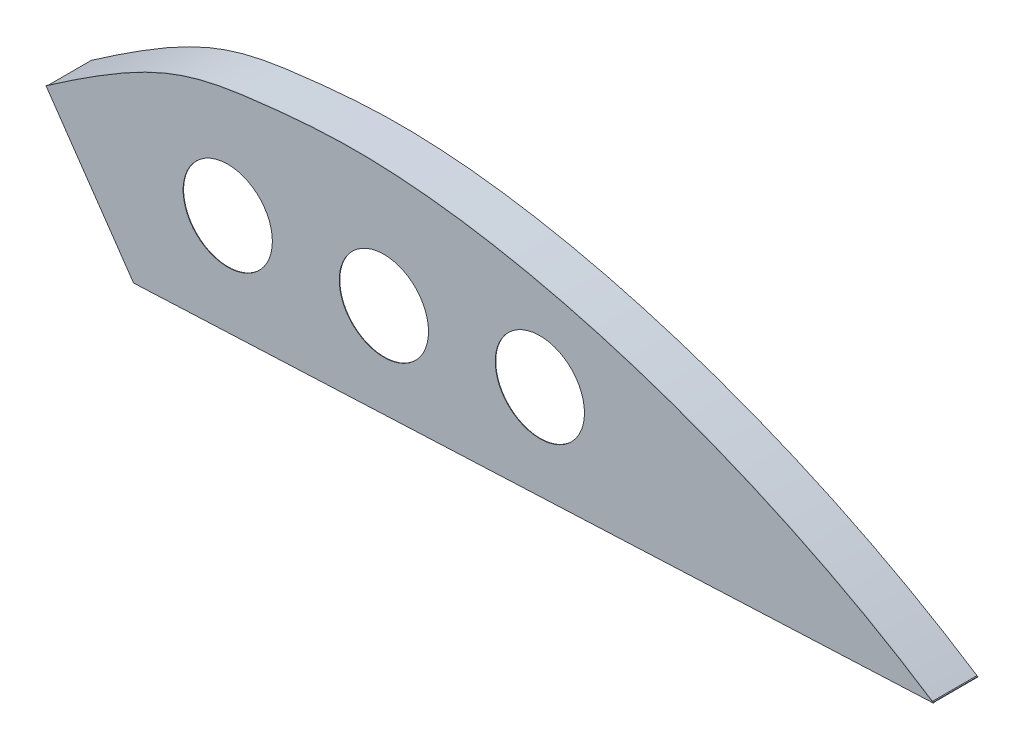
ISO-10303-21;
HEADER;
FILE_DESCRIPTION(('STEP AP214'),'2;1');
FILE_NAME('part.step','',(''),(''),'','','');
FILE_SCHEMA(('AUTOMOTIVE_DESIGN { 1 0 10303 214 1 1 1 1 }'));
ENDSEC;
DATA;
#1=APPLICATION_CONTEXT('core data for automotive mechanical design processes');
#2=APPLICATION_PROTOCOL_DEFINITION('international standard','automotive_design',2000,#1);
#3=PRODUCT_CONTEXT('',#1,'mechanical');
#4=PRODUCT('Part','Part','',(#3));
#5=PRODUCT_RELATED_PRODUCT_CATEGORY('part','',(#4));
#6=PRODUCT_DEFINITION_FORMATION('','',#4);
#7=PRODUCT_DEFINITION_CONTEXT('part definition',#1,'design');
#8=PRODUCT_DEFINITION('design','',#6,#7);
#9=PRODUCT_DEFINITION_SHAPE('','',#8);
#10=(LENGTH_UNIT() NAMED_UNIT(*) SI_UNIT(.MILLI.,.METRE.));
#11=(NAMED_UNIT(*) PLANE_ANGLE_UNIT() SI_UNIT($,.RADIAN.));
#12=(NAMED_UNIT(*) SI_UNIT($,.STERADIAN.) SOLID_ANGLE_UNIT());
#13=UNCERTAINTY_MEASURE_WITH_UNIT(LENGTH_MEASURE(1.E-05),#10,'distance_accuracy_value','');
#14=(GEOMETRIC_REPRESENTATION_CONTEXT(3) GLOBAL_UNCERTAINTY_ASSIGNED_CONTEXT((#13)) GLOBAL_UNIT_ASSIGNED_CONTEXT((#10,
#11,#12)) REPRESENTATION_CONTEXT('',''));
#15=CARTESIAN_POINT('',(0.,0.,0.));
#16=DIRECTION('',(0.,0.,1.));
#17=DIRECTION('',(1.,0.,0.));
#18=AXIS2_PLACEMENT_3D('',#15,#16,#17);
#19=CARTESIAN_POINT('',(-1659.53553734202,615.24308702669,-0.099999999999989));
#20=DIRECTION('',(0.,0.,-1.));
#21=DIRECTION('',(1.,0.,0.));
#22=AXIS2_PLACEMENT_3D('',#19,#20,#21);
#23=PLANE('',#22);
#24=CARTESIAN_POINT('',(-1702.86573801061,588.986400452499,-0.099999999999989));
#25=DIRECTION('',(0.,0.,1.));
#26=DIRECTION('',(1.,0.,0.));
#27=AXIS2_PLACEMENT_3D('',#24,#25,#26);
#28=CIRCLE('',#27,10.0000000000001);
#29=CARTESIAN_POINT('',(-1692.86573801061,588.986400452499,-0.099999999999989));
#30=VERTEX_POINT('',#29);
#31=EDGE_CURVE('E274',#30,#30,#28,.T.);
#32=ORIENTED_EDGE('',*,*,#31,.T.);
#33=EDGE_LOOP('',(#32));
#34=FACE_BOUND('',#33,.T.);
#35=CARTESIAN_POINT('',(-1667.86573801061,588.986400452499,-0.099999999999989));
#36=DIRECTION('',(0.,0.,1.));
#37=DIRECTION('',(1.,0.,0.));
#38=AXIS2_PLACEMENT_3D('',#35,#36,#37);
#39=CIRCLE('',#38,9.99999999999985);
#40=CARTESIAN_POINT('',(-1657.86573801061,588.986400452499,-0.099999999999989));
#41=VERTEX_POINT('',#40);
#42=EDGE_CURVE('E242',#41,#41,#39,.T.);
#43=ORIENTED_EDGE('',*,*,#42,.T.);
#44=EDGE_LOOP('',(#43));
#45=FACE_BOUND('',#44,.T.);
#46=CARTESIAN_POINT('',(-1632.90629090363,590.67075729533,-0.099999999999989));
#47=DIRECTION('',(0.,0.,1.));
#48=DIRECTION('',(1.,0.,0.));
#49=AXIS2_PLACEMENT_3D('',#46,#47,#48);
#50=CIRCLE('',#49,10.0000000000001);
#51=CARTESIAN_POINT('',(-1622.90629090363,590.67075729533,-0.099999999999989));
#52=VERTEX_POINT('',#51);
#53=EDGE_CURVE('E279',#52,#52,#50,.T.);
#54=ORIENTED_EDGE('',*,*,#53,.T.);
#55=EDGE_LOOP('',(#54));
#56=FACE_BOUND('',#55,.T.);
#57=DIRECTION('',(0.567607096396232,-0.823299571310856,0.));
#58=VECTOR('',#57,1.);
#59=CARTESIAN_POINT('',(-1743.60796018332,593.83047017767,-0.099999999999989));
#60=LINE('',#59,#58);
#61=CARTESIAN_POINT('',(-1743.60796018332,593.83047017767,-0.099999999999989));
#62=VERTEX_POINT('',#61);
#63=CARTESIAN_POINT('',(-1743.55109327918,593.748213839778,-0.099999999999989));
#64=VERTEX_POINT('',#63);
#65=EDGE_CURVE('E263',#62,#64,#60,.T.);
#66=ORIENTED_EDGE('',*,*,#65,.F.);
#67=CARTESIAN_POINT('',(-1544.64995665935,573.441433080312,-0.099999999999989));
#68=CARTESIAN_POINT('',(-1585.71664888804,600.423930322912,-0.099999999999989));
#69=CARTESIAN_POINT('',(-1646.28028973819,619.241808081414,-0.099999999999989));
#70=CARTESIAN_POINT('',(-1709.38954114273,613.399774738818,-0.099999999999989));
#71=CARTESIAN_POINT('',(-1719.50790421298,610.537812827554,-0.099999999999989));
#72=CARTESIAN_POINT('',(-1743.60796018332,593.83047017767,-0.099999999999989));
#73=B_SPLINE_CURVE_WITH_KNOTS('',3,(#67,#68,#69,#70,#71,#72),.UNSPECIFIED.,.F.,.F.,(4,1,1,4),
(0.,0.579445357910707,0.679445357910707,1.),.UNSPECIFIED.);
#74=CARTESIAN_POINT('',(-1544.64995665935,573.441433080312,-0.099999999999989));
#75=VERTEX_POINT('',#74);
#76=EDGE_CURVE('E257',#75,#62,#73,.T.);
#77=ORIENTED_EDGE('',*,*,#76,.F.);
#78=DIRECTION('',(0.998984631984055,0.0450522481090856,0.));
#79=VECTOR('',#78,1.);
#80=CARTESIAN_POINT('',(-1723.97557604015,565.354199265099,-0.099999999999989));
#81=LINE('',#80,#79);
#82=CARTESIAN_POINT('',(-1544.79832647999,573.434741892322,-0.099999999999989));
#83=VERTEX_POINT('',#82);
#84=EDGE_CURVE('E250',#83,#75,#81,.T.);
#85=ORIENTED_EDGE('',*,*,#84,.F.);
#86=DIRECTION('',(0.0450522481076401,-0.99898463198412,0.));
#87=VECTOR('',#86,1.);
#88=CARTESIAN_POINT('',(-1515.85454878512,-68.3620678841911,-0.099999999999989));
#89=LINE('',#88,#87);
#90=CARTESIAN_POINT('',(-1544.80283170476,573.53464035455,-0.099999999999989));
#91=VERTEX_POINT('',#90);
#92=EDGE_CURVE('E142',#91,#83,#89,.T.);
#93=ORIENTED_EDGE('',*,*,#92,.F.);
#94=DIRECTION('',(-0.998984631984301,-0.045052248103632,0.));
#95=VECTOR('',#94,1.);
#96=CARTESIAN_POINT('',(-28.9482829167909,641.896708232776,-0.099999999999989));
#97=LINE('',#96,#95);
#98=CARTESIAN_POINT('',(-1724.02778305262,565.451946471216,-0.099999999999989));
#99=VERTEX_POINT('',#98);
#100=EDGE_CURVE('E298',#91,#99,#97,.T.);
#101=ORIENTED_EDGE('',*,*,#100,.T.);
#102=DIRECTION('',(-0.47111626041238,0.882071124782494,0.));
#103=VECTOR('',#102,1.);
#104=CARTESIAN_POINT('',(-1106.4007933582,-590.931263522244,-0.099999999999989));
#105=LINE('',#104,#103);
#106=CARTESIAN_POINT('',(-1723.97557604015,565.354199265099,-0.099999999999989));
#107=VERTEX_POINT('',#106);
#108=EDGE_CURVE('E294',#107,#99,#105,.T.);
#109=ORIENTED_EDGE('',*,*,#108,.F.);
#110=EDGE_CURVE('E261',#64,#107,#60,.T.);
#111=ORIENTED_EDGE('',*,*,#110,.F.);
#112=DIRECTION('',(0.569732881743784,-0.821829935850431,0.));
#113=VECTOR('',#112,1.);
#114=CARTESIAN_POINT('',(-1743.55098689514,593.748287184085,-0.099999999999989));
#115=LINE('',#114,#113);
#116=CARTESIAN_POINT('',(-1743.49401360697,593.6661041905,-0.099999999999989));
#117=VERTEX_POINT('',#116);
#118=EDGE_CURVE('E137',#64,#117,#115,.T.);
#119=ORIENTED_EDGE('',*,*,#118,.T.);
#120=CARTESIAN_POINT('',(-1743.49401360697,593.6661041905,-0.099999999999989));
#121=CARTESIAN_POINT('',(-1742.91824458099,594.065255562428,-0.099999999999989));
#122=CARTESIAN_POINT('',(-1741.74997008711,594.87141177884,-0.099999999999989));
#123=CARTESIAN_POINT('',(-1739.52608503396,596.390203290393,-0.099999999999989));
#124=CARTESIAN_POINT('',(-1736.86780536305,598.174714984535,-0.099999999999989));
#125=CARTESIAN_POINT('',(-1733.88088062316,600.125360581456,-0.099999999999989));
#126=CARTESIAN_POINT('',(-1730.13578168037,602.491531609271,-0.099999999999989));
#127=CARTESIAN_POINT('',(-1725.8592623092,605.030940978585,-0.099999999999989));
#128=CARTESIAN_POINT('',(-1721.23073897954,607.488971472819,-0.099999999999989));
#129=CARTESIAN_POINT('',(-1716.9625897087,609.437107419647,-0.099999999999989));
#130=CARTESIAN_POINT('',(-1711.55998553951,611.46096428712,-0.099999999999989));
#131=CARTESIAN_POINT('',(-1704.98089947417,613.11709117934,-0.099999999999989));
#132=CARTESIAN_POINT('',(-1697.68082062827,614.126469300054,-0.099999999999989));
#133=CARTESIAN_POINT('',(-1690.80335479769,614.881158472113,-0.099999999999989));
#134=CARTESIAN_POINT('',(-1683.28277337287,615.549802626292,-0.099999999999989));
#135=CARTESIAN_POINT('',(-1672.98979224295,615.951202382142,-0.099999999999989));
#136=CARTESIAN_POINT('',(-1659.83071516774,615.23991316832,-0.099999999999989));
#137=CARTESIAN_POINT('',(-1645.98401951836,613.443251496951,-0.099999999999989));
#138=CARTESIAN_POINT('',(-1626.86027597132,609.633108879136,-0.099999999999989));
#139=CARTESIAN_POINT('',(-1607.08890876547,603.79419794508,-0.099999999999989));
#140=CARTESIAN_POINT('',(-1587.37621875447,596.094131565289,-0.099999999999989));
#141=CARTESIAN_POINT('',(-1572.79576399986,589.430500324178,-0.099999999999989));
#142=CARTESIAN_POINT('',(-1560.96559801228,583.174479228299,-0.099999999999989));
#143=CARTESIAN_POINT('',(-1551.77383994312,577.764017719539,-0.099999999999989));
#144=CARTESIAN_POINT('',(-1547.2965646056,574.935715783377,-0.099999999999989));
#145=CARTESIAN_POINT('',(-1545.07786027003,573.482918258107,-0.099999999999989));
#146=B_SPLINE_CURVE_WITH_KNOTS('',3,(#120,#121,#122,#123,#124,#125,#126,#127,#128,#129,#130,
#131,#132,#133,#134,#135,#136,#137,#138,#139,#140,#141,#142,#143,#144,#145),.UNSPECIFIED.,.F.,
.F.,(4,1,1,1,1,1,1,1,1,1,1,1,1,1,1,1,1,1,1,1,1,1,1,4),(0.00149626207873581,0.00929707253124572,
0.0170978829837556,0.0326995038887753,0.0483011247937951,0.0639027456988149,0.0951059875088543,
0.126309229318894,0.157512471128933,0.188715712938973,0.251122196559052,0.313528680179131,
0.34473192198917,0.37593516379921,0.438341647419289,0.500748131039368,0.563154614659447,
0.625561098279526,0.750374065519684,0.812780549139763,0.875187032759842,0.937593516379921,
0.96879675818996,1.),.UNSPECIFIED.);
#147=CARTESIAN_POINT('',(-1545.18274259782,573.551556110464,-0.099999999999989));
#148=VERTEX_POINT('',#147);
#149=EDGE_CURVE('E185',#117,#148,#146,.T.);
#150=ORIENTED_EDGE('',*,*,#149,.T.);
#151=DIRECTION('',(0.995602692003064,0.093676462765476,0.));
#152=VECTOR('',#151,1.);
#153=CARTESIAN_POINT('',(-1545.02307971105,573.566578824431,-0.099999999999989));
#154=LINE('',#153,#152);
#155=CARTESIAN_POINT('',(-1545.02307971105,573.566578824431,-0.099999999999989));
#156=VERTEX_POINT('',#155);
#157=EDGE_CURVE('E148',#148,#156,#154,.T.);
#158=ORIENTED_EDGE('',*,*,#157,.T.);
#159=CARTESIAN_POINT('',(-1743.55098689514,593.748287184085,-0.0999999999999977));
#160=CARTESIAN_POINT('',(-1734.15508646799,600.261986908841,-0.0999999999999977));
#161=CARTESIAN_POINT('',(-1727.25276065684,604.565604120329,-0.0999999999999977));
#162=CARTESIAN_POINT('',(-1715.3642242429,610.448022257473,-0.0999999999999977));
#163=CARTESIAN_POINT('',(-1710.37850281503,612.027658052934,-0.0999999999999977));
#164=CARTESIAN_POINT('',(-1702.01910126724,613.629485697198,-0.0999999999999977));
#165=CARTESIAN_POINT('',(-1699.08573934283,614.035305054447,-0.0999999999999977));
#166=CARTESIAN_POINT('',(-1694.17704598943,614.610346383111,-0.0999999999999977));
#167=CARTESIAN_POINT('',(-1692.45037214897,614.800321889409,-0.0999999999999977));
#168=CARTESIAN_POINT('',(-1688.83699666007,615.157146300184,-0.0999999999999977));
#169=CARTESIAN_POINT('',(-1685.06731264814,615.488156685975,-0.0999999999999977));
#170=CARTESIAN_POINT('',(-1681.05156214421,615.710135669524,-0.0999999999999977));
#171=CARTESIAN_POINT('',(-1676.94608228937,615.848904452693,-0.0999999999999977));
#172=CARTESIAN_POINT('',(-1674.85027289541,615.874635066804,-0.0999999999999977));
#173=CARTESIAN_POINT('',(-1668.46062374473,615.803565887457,-0.0999999999999977));
#174=CARTESIAN_POINT('',(-1664.05894449368,615.565415197453,-0.0999999999999977));
#175=CARTESIAN_POINT('',(-1623.54009886868,611.778467090323,-0.0999999999999994));
#176=CARTESIAN_POINT('',(-1580.38557088221,596.721777485763,-0.0999999999999977));
#177=CARTESIAN_POINT('',(-1545.02307971105,573.566578824431,-0.0999999999999977));
#178=B_SPLINE_CURVE_WITH_KNOTS('',3,(#159,#160,#161,#162,#163,#164,#165,#166,#167,#168,#169,
#170,#171,#172,#173,#174,#175,#176,#177),.UNSPECIFIED.,.F.,.F.,(4,2,2,2,2,1,2,2,2,4),
(0.00149626207873332,0.126496262078728,0.251496262078722,0.313996262078717,0.345246262078717,
0.376496262078716,0.407746262078716,0.438996262078716,0.501496262078718,1.),.UNSPECIFIED.);
#179=EDGE_CURVE('E313',#156,#64,#178,.F.);
#180=ORIENTED_EDGE('',*,*,#179,.T.);
#181=EDGE_LOOP('',(#66,#77,#85,#93,#101,#109,#111,#119,#150,#158,#180));
#182=FACE_BOUND('',#181,.T.);
#183=ADVANCED_FACE('F34',(#34,#45,#56,#182),#23,.T.);
#184=CARTESIAN_POINT('',(-1659.53553734202,615.24308702669,0.));
#185=DIRECTION('',(0.,0.,-1.));
#186=DIRECTION('',(1.,0.,0.));
#187=AXIS2_PLACEMENT_3D('',#184,#185,#186);
#188=PLANE('',#187);
#189=CARTESIAN_POINT('',(-1544.64995665935,573.441433080312,0.));
#190=CARTESIAN_POINT('',(-1585.71664888804,600.423930322912,0.));
#191=CARTESIAN_POINT('',(-1646.28028973819,619.241808081414,0.));
#192=CARTESIAN_POINT('',(-1709.38954114273,613.399774738818,0.));
#193=CARTESIAN_POINT('',(-1719.50790421298,610.537812827554,0.));
#194=CARTESIAN_POINT('',(-1743.60796018332,593.83047017767,0.));
#195=B_SPLINE_CURVE_WITH_KNOTS('',3,(#189,#190,#191,#192,#193,#194),.UNSPECIFIED.,.F.,.F.,(4,1,
1,4),(0.,0.579445357910707,0.679445357910707,1.),.UNSPECIFIED.);
#196=CARTESIAN_POINT('',(-1544.64995665935,573.441433080312,0.));
#197=VERTEX_POINT('',#196);
#198=CARTESIAN_POINT('',(-1743.60796018332,593.83047017767,0.));
#199=VERTEX_POINT('',#198);
#200=EDGE_CURVE('E238',#197,#199,#195,.T.);
#201=ORIENTED_EDGE('',*,*,#200,.T.);
#202=DIRECTION('',(0.567607096396232,-0.823299571310856,0.));
#203=VECTOR('',#202,1.);
#204=CARTESIAN_POINT('',(-1743.60796018332,593.83047017767,0.));
#205=LINE('',#204,#203);
#206=CARTESIAN_POINT('',(-1723.97557604015,565.354199265099,0.));
#207=VERTEX_POINT('',#206);
#208=EDGE_CURVE('E229',#199,#207,#205,.T.);
#209=ORIENTED_EDGE('',*,*,#208,.T.);
#210=DIRECTION('',(0.998984631984055,0.0450522481090856,0.));
#211=VECTOR('',#210,1.);
#212=CARTESIAN_POINT('',(-1723.97557604015,565.354199265099,0.));
#213=LINE('',#212,#211);
#214=EDGE_CURVE('E237',#207,#197,#213,.T.);
#215=ORIENTED_EDGE('',*,*,#214,.T.);
#216=EDGE_LOOP('',(#201,#209,#215));
#217=FACE_BOUND('',#216,.T.);
#218=CARTESIAN_POINT('',(-1667.86573801061,588.986400452499,0.));
#219=DIRECTION('',(0.,0.,1.));
#220=DIRECTION('',(1.,0.,0.));
#221=AXIS2_PLACEMENT_3D('',#218,#219,#220);
#222=CIRCLE('',#221,9.99999999999985);
#223=CARTESIAN_POINT('',(-1657.86573801061,588.986400452499,0.));
#224=VERTEX_POINT('',#223);
#225=EDGE_CURVE('E245',#224,#224,#222,.T.);
#226=ORIENTED_EDGE('',*,*,#225,.F.);
#227=EDGE_LOOP('',(#226));
#228=FACE_BOUND('',#227,.T.);
#229=CARTESIAN_POINT('',(-1702.86573801061,588.986400452499,0.));
#230=DIRECTION('',(0.,0.,1.));
#231=DIRECTION('',(1.,0.,0.));
#232=AXIS2_PLACEMENT_3D('',#229,#230,#231);
#233=CIRCLE('',#232,10.0000000000001);
#234=CARTESIAN_POINT('',(-1692.86573801061,588.986400452499,0.));
#235=VERTEX_POINT('',#234);
#236=EDGE_CURVE('E276',#235,#235,#233,.T.);
#237=ORIENTED_EDGE('',*,*,#236,.F.);
#238=EDGE_LOOP('',(#237));
#239=FACE_BOUND('',#238,.T.);
#240=CARTESIAN_POINT('',(-1632.90629090363,590.67075729533,0.));
#241=DIRECTION('',(0.,0.,1.));
#242=DIRECTION('',(1.,0.,0.));
#243=AXIS2_PLACEMENT_3D('',#240,#241,#242);
#244=CIRCLE('',#243,10.0000000000001);
#245=CARTESIAN_POINT('',(-1622.90629090363,590.67075729533,0.));
#246=VERTEX_POINT('',#245);
#247=EDGE_CURVE('E281',#246,#246,#244,.T.);
#248=ORIENTED_EDGE('',*,*,#247,.F.);
#249=EDGE_LOOP('',(#248));
#250=FACE_BOUND('',#249,.T.);
#251=ADVANCED_FACE('F203',(#217,#228,#239,#250),#188,.F.);
#252=DIRECTION('',(0.,0.,1.));
#253=VECTOR('',#252,1.);
#254=SURFACE_OF_LINEAR_EXTRUSION('',#73,#253);
#255=ORIENTED_EDGE('',*,*,#200,.F.);
#256=DIRECTION('',(0.,0.,1.));
#257=VECTOR('',#256,1.);
#258=CARTESIAN_POINT('',(-1544.64995665935,573.441433080312,-0.099999999999989));
#259=LINE('',#258,#257);
#260=EDGE_CURVE('E258',#75,#197,#259,.T.);
#261=ORIENTED_EDGE('',*,*,#260,.F.);
#262=ORIENTED_EDGE('',*,*,#76,.T.);
#263=DIRECTION('',(0.,0.,1.));
#264=VECTOR('',#263,1.);
#265=CARTESIAN_POINT('',(-1743.60796018332,593.83047017767,-0.099999999999989));
#266=LINE('',#265,#264);
#267=EDGE_CURVE('E11',#62,#199,#266,.T.);
#268=ORIENTED_EDGE('',*,*,#267,.T.);
#269=EDGE_LOOP('',(#255,#261,#262,#268));
#270=FACE_BOUND('',#269,.T.);
#271=ADVANCED_FACE('F36',(#270),#254,.T.);
#272=CARTESIAN_POINT('',(-1743.60796018332,593.83047017767,-0.099999999999989));
#273=DIRECTION('',(0.823299571310856,0.567607096396232,0.));
#274=DIRECTION('',(-0.567607096396232,0.823299571310856,0.));
#275=AXIS2_PLACEMENT_3D('',#272,#273,#274);
#276=PLANE('',#275);
#277=ORIENTED_EDGE('',*,*,#208,.F.);
#278=ORIENTED_EDGE('',*,*,#267,.F.);
#279=ORIENTED_EDGE('',*,*,#65,.T.);
#280=ORIENTED_EDGE('',*,*,#110,.T.);
#281=DIRECTION('',(0.,0.,1.));
#282=VECTOR('',#281,1.);
#283=CARTESIAN_POINT('',(-1723.97557604015,565.354199265099,-0.099999999999989));
#284=LINE('',#283,#282);
#285=EDGE_CURVE('E46',#107,#207,#284,.T.);
#286=ORIENTED_EDGE('',*,*,#285,.T.);
#287=EDGE_LOOP('',(#277,#278,#279,#280,#286));
#288=FACE_BOUND('',#287,.T.);
#289=ADVANCED_FACE('F219',(#288),#276,.F.);
#290=CARTESIAN_POINT('',(-1723.97557604015,565.354199265099,-0.099999999999989));
#291=DIRECTION('',(-0.0450522481090856,0.998984631984055,0.));
#292=DIRECTION('',(-0.998984631984055,-0.0450522481090857,0.));
#293=AXIS2_PLACEMENT_3D('',#290,#291,#292);
#294=PLANE('',#293);
#295=ORIENTED_EDGE('',*,*,#214,.F.);
#296=ORIENTED_EDGE('',*,*,#285,.F.);
#297=DIRECTION('',(0.,0.,1.));
#298=VECTOR('',#297,1.);
#299=CARTESIAN_POINT('',(-1723.97557604015,565.354199265099,-10.1));
#300=LINE('',#299,#298);
#301=CARTESIAN_POINT('',(-1723.97557604015,565.354199265099,-10.1));
#302=VERTEX_POINT('',#301);
#303=EDGE_CURVE('E289',#302,#107,#300,.T.);
#304=ORIENTED_EDGE('',*,*,#303,.F.);
#305=DIRECTION('',(0.998984631984055,0.0450522481090856,0.));
#306=VECTOR('',#305,1.);
#307=CARTESIAN_POINT('',(-28.9437776959012,641.796809778665,-10.1));
#308=LINE('',#307,#306);
#309=CARTESIAN_POINT('',(-1544.79832647999,573.434741892322,-10.1));
#310=VERTEX_POINT('',#309);
#311=EDGE_CURVE('E293',#302,#310,#308,.T.);
#312=ORIENTED_EDGE('',*,*,#311,.T.);
#313=DIRECTION('',(0.,0.,1.));
#314=VECTOR('',#313,1.);
#315=CARTESIAN_POINT('',(-1544.79832647999,573.434741892322,-10.1));
#316=LINE('',#315,#314);
#317=EDGE_CURVE('E291',#310,#83,#316,.T.);
#318=ORIENTED_EDGE('',*,*,#317,.T.);
#319=ORIENTED_EDGE('',*,*,#84,.T.);
#320=ORIENTED_EDGE('',*,*,#260,.T.);
#321=EDGE_LOOP('',(#295,#296,#304,#312,#318,#319,#320));
#322=FACE_BOUND('',#321,.T.);
#323=ADVANCED_FACE('F217',(#322),#294,.F.);
#324=CARTESIAN_POINT('',(-1667.86573801061,588.986400452499,-0.099999999999989));
#325=DIRECTION('',(0.,0.,1.));
#326=DIRECTION('',(-1.,0.,0.));
#327=AXIS2_PLACEMENT_3D('',#324,#325,#326);
#328=CYLINDRICAL_SURFACE('',#327,9.99999999999985);
#329=ORIENTED_EDGE('',*,*,#42,.F.);
#330=EDGE_LOOP('',(#329));
#331=FACE_BOUND('',#330,.T.);
#332=ORIENTED_EDGE('',*,*,#225,.T.);
#333=EDGE_LOOP('',(#332));
#334=FACE_BOUND('',#333,.T.);
#335=ADVANCED_FACE('F214',(#331,#334),#328,.F.);
#336=CARTESIAN_POINT('',(-1702.86573801061,588.986400452499,-0.099999999999989));
#337=DIRECTION('',(0.,0.,1.));
#338=DIRECTION('',(-1.,0.,0.));
#339=AXIS2_PLACEMENT_3D('',#336,#337,#338);
#340=CYLINDRICAL_SURFACE('',#339,10.0000000000001);
#341=ORIENTED_EDGE('',*,*,#31,.F.);
#342=EDGE_LOOP('',(#341));
#343=FACE_BOUND('',#342,.T.);
#344=ORIENTED_EDGE('',*,*,#236,.T.);
#345=EDGE_LOOP('',(#344));
#346=FACE_BOUND('',#345,.T.);
#347=ADVANCED_FACE('F364',(#343,#346),#340,.F.);
#348=CARTESIAN_POINT('',(-1632.90629090363,590.67075729533,-0.099999999999989));
#349=DIRECTION('',(0.,0.,1.));
#350=DIRECTION('',(-1.,0.,0.));
#351=AXIS2_PLACEMENT_3D('',#348,#349,#350);
#352=CYLINDRICAL_SURFACE('',#351,10.0000000000001);
#353=ORIENTED_EDGE('',*,*,#53,.F.);
#354=EDGE_LOOP('',(#353));
#355=FACE_BOUND('',#354,.T.);
#356=ORIENTED_EDGE('',*,*,#247,.T.);
#357=EDGE_LOOP('',(#356));
#358=FACE_BOUND('',#357,.T.);
#359=ADVANCED_FACE('F362',(#355,#358),#352,.F.);
#360=CARTESIAN_POINT('',(-1515.85454878512,-68.3620678841911,-10.1));
#361=DIRECTION('',(0.99898463198412,0.0450522481076401,0.));
#362=DIRECTION('',(-0.0450522481076401,0.99898463198412,0.));
#363=AXIS2_PLACEMENT_3D('',#360,#361,#362);
#364=PLANE('',#363);
#365=ORIENTED_EDGE('',*,*,#92,.T.);
#366=ORIENTED_EDGE('',*,*,#317,.F.);
#367=DIRECTION('',(0.0450522481076401,-0.99898463198412,0.));
#368=VECTOR('',#367,1.);
#369=CARTESIAN_POINT('',(-1515.85454878512,-68.3620678841911,-10.1));
#370=LINE('',#369,#368);
#371=CARTESIAN_POINT('',(-1544.80283170476,573.53464035455,-10.1));
#372=VERTEX_POINT('',#371);
#373=EDGE_CURVE('E297',#372,#310,#370,.T.);
#374=ORIENTED_EDGE('',*,*,#373,.F.);
#375=DIRECTION('',(0.,0.,1.));
#376=VECTOR('',#375,1.);
#377=CARTESIAN_POINT('',(-1544.80283170476,573.53464035455,-10.1));
#378=LINE('',#377,#376);
#379=EDGE_CURVE('E62',#372,#91,#378,.T.);
#380=ORIENTED_EDGE('',*,*,#379,.T.);
#381=EDGE_LOOP('',(#365,#366,#374,#380));
#382=FACE_BOUND('',#381,.T.);
#383=ADVANCED_FACE('F344',(#382),#364,.T.);
#384=CARTESIAN_POINT('',(-28.9482829167909,641.896708232776,-10.1));
#385=DIRECTION('',(0.045052248103632,-0.998984631984301,0.));
#386=DIRECTION('',(0.998984631984301,0.045052248103632,0.));
#387=AXIS2_PLACEMENT_3D('',#384,#385,#386);
#388=PLANE('',#387);
#389=ORIENTED_EDGE('',*,*,#100,.F.);
#390=ORIENTED_EDGE('',*,*,#379,.F.);
#391=DIRECTION('',(-0.998984631984301,-0.045052248103632,0.));
#392=VECTOR('',#391,1.);
#393=CARTESIAN_POINT('',(-28.9482829167909,641.896708232776,-10.1));
#394=LINE('',#393,#392);
#395=CARTESIAN_POINT('',(-1724.02778305262,565.451946471216,-10.1));
#396=VERTEX_POINT('',#395);
#397=EDGE_CURVE('E306',#372,#396,#394,.T.);
#398=ORIENTED_EDGE('',*,*,#397,.T.);
#399=DIRECTION('',(0.,0.,1.));
#400=VECTOR('',#399,1.);
#401=CARTESIAN_POINT('',(-1724.02778305262,565.451946471216,-10.1));
#402=LINE('',#401,#400);
#403=EDGE_CURVE('E287',#396,#99,#402,.T.);
#404=ORIENTED_EDGE('',*,*,#403,.T.);
#405=EDGE_LOOP('',(#389,#390,#398,#404));
#406=FACE_BOUND('',#405,.T.);
#407=ADVANCED_FACE('F350',(#406),#388,.F.);
#408=CARTESIAN_POINT('',(-1106.4007933582,-590.931263522244,-10.1));
#409=DIRECTION('',(-0.882071124782494,-0.47111626041238,0.));
#410=DIRECTION('',(0.47111626041238,-0.882071124782494,0.));
#411=AXIS2_PLACEMENT_3D('',#408,#409,#410);
#412=PLANE('',#411);
#413=ORIENTED_EDGE('',*,*,#108,.T.);
#414=ORIENTED_EDGE('',*,*,#403,.F.);
#415=DIRECTION('',(-0.47111626041238,0.882071124782494,0.));
#416=VECTOR('',#415,1.);
#417=CARTESIAN_POINT('',(-1106.4007933582,-590.931263522244,-10.1));
#418=LINE('',#417,#416);
#419=EDGE_CURVE('E304',#302,#396,#418,.T.);
#420=ORIENTED_EDGE('',*,*,#419,.F.);
#421=ORIENTED_EDGE('',*,*,#303,.T.);
#422=EDGE_LOOP('',(#413,#414,#420,#421));
#423=FACE_BOUND('',#422,.T.);
#424=ADVANCED_FACE('F352',(#423),#412,.T.);
#425=CARTESIAN_POINT('',(0.,0.,-10.1));
#426=DIRECTION('',(0.,0.,-1.));
#427=DIRECTION('',(1.,0.,0.));
#428=AXIS2_PLACEMENT_3D('',#425,#426,#427);
#429=PLANE('',#428);
#430=ORIENTED_EDGE('',*,*,#373,.T.);
#431=ORIENTED_EDGE('',*,*,#311,.F.);
#432=ORIENTED_EDGE('',*,*,#419,.T.);
#433=ORIENTED_EDGE('',*,*,#397,.F.);
#434=EDGE_LOOP('',(#430,#431,#432,#433));
#435=FACE_BOUND('',#434,.T.);
#436=ADVANCED_FACE('F170',(#435),#429,.T.);
#437=CARTESIAN_POINT('',(-1544.70486849794,573.357858622593,-10.1));
#438=CARTESIAN_POINT('',(-1580.12644929968,596.631286659827,-10.1));
#439=CARTESIAN_POINT('',(-1623.43203040481,611.768366860211,-10.1));
#440=CARTESIAN_POINT('',(-1664.05894449368,615.565415197453,-10.1));
#441=CARTESIAN_POINT('',(-1668.46062374473,615.803565887457,-10.1));
#442=CARTESIAN_POINT('',(-1674.85027289541,615.874635066804,-10.1));
#443=CARTESIAN_POINT('',(-1676.94608228937,615.848904452693,-10.1));
#444=CARTESIAN_POINT('',(-1681.05156214421,615.710135669524,-10.1));
#445=CARTESIAN_POINT('',(-1685.06731264814,615.488156685975,-10.1));
#446=CARTESIAN_POINT('',(-1688.83699666007,615.157146300184,-10.1));
#447=CARTESIAN_POINT('',(-1692.45037214897,614.800321889409,-10.1));
#448=CARTESIAN_POINT('',(-1694.17704598943,614.610346383111,-10.1));
#449=CARTESIAN_POINT('',(-1699.08573934283,614.035305054447,-10.1));
#450=CARTESIAN_POINT('',(-1702.01910126724,613.629485697198,-10.1));
#451=CARTESIAN_POINT('',(-1710.37850281503,612.027658052934,-10.1));
#452=CARTESIAN_POINT('',(-1715.3642242429,610.448022257473,-10.1));
#453=CARTESIAN_POINT('',(-1727.25276065684,604.565604120329,-10.1));
#454=CARTESIAN_POINT('',(-1734.15508646799,600.261986908841,-10.1));
#455=CARTESIAN_POINT('',(-1743.55098689514,593.748287184085,-10.1));
#456=B_SPLINE_CURVE_WITH_KNOTS('',3,(#437,#438,#439,#440,#441,#442,#443,#444,#445,#446,#447,
#448,#449,#450,#451,#452,#453,#454,#455),.UNSPECIFIED.,.F.,.F.,(4,2,2,2,1,2,2,2,2,4),(0.,
0.500000000000015,0.562500000000018,0.593750000000017,0.625000000000017,0.656250000000016,
0.687500000000016,0.750000000000011,0.875000000000006,1.),.UNSPECIFIED.);
#457=DIRECTION('',(0.,0.,1.));
#458=VECTOR('',#457,1.);
#459=SURFACE_OF_LINEAR_EXTRUSION('',#456,#458);
#460=ORIENTED_EDGE('',*,*,#179,.F.);
#461=DIRECTION('',(0.,0.,1.));
#462=VECTOR('',#461,1.);
#463=CARTESIAN_POINT('',(-1545.02307971105,573.566578824431,-10.1));
#464=LINE('',#463,#462);
#465=CARTESIAN_POINT('',(-1545.02307971105,573.566578824431,-10.1));
#466=VERTEX_POINT('',#465);
#467=EDGE_CURVE('E147',#466,#156,#464,.T.);
#468=ORIENTED_EDGE('',*,*,#467,.F.);
#469=CARTESIAN_POINT('',(-1545.02307971105,573.566578824431,-10.1));
#470=CARTESIAN_POINT('',(-1580.38557088221,596.721777485763,-10.1));
#471=CARTESIAN_POINT('',(-1623.54009886868,611.778467090323,-10.1));
#472=CARTESIAN_POINT('',(-1664.05894449368,615.565415197453,-10.1));
#473=CARTESIAN_POINT('',(-1668.46062374473,615.803565887457,-10.1));
#474=CARTESIAN_POINT('',(-1674.85027289541,615.874635066804,-10.1));
#475=CARTESIAN_POINT('',(-1676.94608228937,615.848904452693,-10.1));
#476=CARTESIAN_POINT('',(-1681.05156214421,615.710135669524,-10.1));
#477=CARTESIAN_POINT('',(-1685.06731264814,615.488156685975,-10.1));
#478=CARTESIAN_POINT('',(-1688.83699666007,615.157146300184,-10.1));
#479=CARTESIAN_POINT('',(-1692.45037214897,614.800321889409,-10.1));
#480=CARTESIAN_POINT('',(-1694.17704598943,614.610346383111,-10.1));
#481=CARTESIAN_POINT('',(-1699.08573934283,614.035305054447,-10.1));
#482=CARTESIAN_POINT('',(-1702.01910126724,613.629485697198,-10.1));
#483=CARTESIAN_POINT('',(-1710.37850281503,612.027658052934,-10.1));
#484=CARTESIAN_POINT('',(-1715.3642242429,610.448022257473,-10.1));
#485=CARTESIAN_POINT('',(-1727.25276065684,604.565604120329,-10.1));
#486=CARTESIAN_POINT('',(-1734.15508646799,600.261986908841,-10.1));
#487=CARTESIAN_POINT('',(-1743.55098689514,593.748287184085,-10.1));
#488=B_SPLINE_CURVE_WITH_KNOTS('',3,(#469,#470,#471,#472,#473,#474,#475,#476,#477,#478,#479,
#480,#481,#482,#483,#484,#485,#486,#487),.UNSPECIFIED.,.F.,.F.,(4,2,2,2,1,2,2,2,2,4),
(0.0014962620787334,0.500000000000015,0.562500000000018,0.593750000000017,0.625000000000017,
0.656250000000016,0.687500000000016,0.750000000000011,0.875000000000006,1.),.UNSPECIFIED.);
#489=CARTESIAN_POINT('',(-1743.55098689514,593.748287184085,-10.1));
#490=VERTEX_POINT('',#489);
#491=EDGE_CURVE('E126',#466,#490,#488,.T.);
#492=ORIENTED_EDGE('',*,*,#491,.T.);
#493=DIRECTION('',(0.,0.,1.));
#494=VECTOR('',#493,1.);
#495=CARTESIAN_POINT('',(-1743.55098689514,593.748287184085,-10.1));
#496=LINE('',#495,#494);
#497=EDGE_CURVE('E134',#490,#64,#496,.T.);
#498=ORIENTED_EDGE('',*,*,#497,.T.);
#499=EDGE_LOOP('',(#460,#468,#492,#498));
#500=FACE_BOUND('',#499,.T.);
#501=ADVANCED_FACE('F146',(#500),#459,.T.);
#502=CARTESIAN_POINT('',(-1743.55098689514,593.748287184085,-10.1));
#503=DIRECTION('',(0.821829935850431,0.569732881743784,0.));
#504=DIRECTION('',(-0.569732881743784,0.821829935850431,0.));
#505=AXIS2_PLACEMENT_3D('',#502,#503,#504);
#506=PLANE('',#505);
#507=ORIENTED_EDGE('',*,*,#118,.F.);
#508=ORIENTED_EDGE('',*,*,#497,.F.);
#509=DIRECTION('',(0.569732881743784,-0.821829935850431,0.));
#510=VECTOR('',#509,1.);
#511=CARTESIAN_POINT('',(-1743.55098689514,593.748287184085,-10.1));
#512=LINE('',#511,#510);
#513=CARTESIAN_POINT('',(-1743.49401360697,593.6661041905,-10.1));
#514=VERTEX_POINT('',#513);
#515=EDGE_CURVE('E122',#490,#514,#512,.T.);
#516=ORIENTED_EDGE('',*,*,#515,.T.);
#517=DIRECTION('',(0.,0.,1.));
#518=VECTOR('',#517,1.);
#519=CARTESIAN_POINT('',(-1743.49401360697,593.6661041905,-10.1));
#520=LINE('',#519,#518);
#521=EDGE_CURVE('E143',#514,#117,#520,.T.);
#522=ORIENTED_EDGE('',*,*,#521,.T.);
#523=EDGE_LOOP('',(#507,#508,#516,#522));
#524=FACE_BOUND('',#523,.T.);
#525=ADVANCED_FACE('F135',(#524),#506,.F.);
#526=CARTESIAN_POINT('',(-1743.49401360697,593.6661041905,-10.1));
#527=CARTESIAN_POINT('',(-1742.91824458099,594.065255562428,-10.1));
#528=CARTESIAN_POINT('',(-1741.74997008711,594.87141177884,-10.1));
#529=CARTESIAN_POINT('',(-1739.52608503396,596.390203290393,-10.1));
#530=CARTESIAN_POINT('',(-1736.86780536305,598.174714984535,-10.1));
#531=CARTESIAN_POINT('',(-1733.88088062316,600.125360581456,-10.1));
#532=CARTESIAN_POINT('',(-1730.13578168037,602.491531609271,-10.1));
#533=CARTESIAN_POINT('',(-1725.8592623092,605.030940978585,-10.1));
#534=CARTESIAN_POINT('',(-1721.23073897954,607.488971472819,-10.1));
#535=CARTESIAN_POINT('',(-1716.9625897087,609.437107419647,-10.1));
#536=CARTESIAN_POINT('',(-1711.55998553951,611.46096428712,-10.1));
#537=CARTESIAN_POINT('',(-1704.98089947417,613.11709117934,-10.1));
#538=CARTESIAN_POINT('',(-1697.68082062827,614.126469300054,-10.1));
#539=CARTESIAN_POINT('',(-1690.80335479769,614.881158472113,-10.1));
#540=CARTESIAN_POINT('',(-1683.28277337287,615.549802626292,-10.1));
#541=CARTESIAN_POINT('',(-1672.98979224295,615.951202382142,-10.1));
#542=CARTESIAN_POINT('',(-1659.83071516774,615.23991316832,-10.1));
#543=CARTESIAN_POINT('',(-1645.98401951836,613.443251496951,-10.1));
#544=CARTESIAN_POINT('',(-1626.86027597132,609.633108879136,-10.1));
#545=CARTESIAN_POINT('',(-1607.08890876547,603.79419794508,-10.1));
#546=CARTESIAN_POINT('',(-1587.37621875447,596.094131565289,-10.1));
#547=CARTESIAN_POINT('',(-1572.79576399986,589.430500324178,-10.1));
#548=CARTESIAN_POINT('',(-1560.96559801228,583.174479228299,-10.1));
#549=CARTESIAN_POINT('',(-1551.77383994312,577.764017719539,-10.1));
#550=CARTESIAN_POINT('',(-1547.2965646056,574.935715783377,-10.1));
#551=CARTESIAN_POINT('',(-1545.07786027003,573.482918258107,-10.1));
#552=B_SPLINE_CURVE_WITH_KNOTS('',3,(#526,#527,#528,#529,#530,#531,#532,#533,#534,#535,#536,
#537,#538,#539,#540,#541,#542,#543,#544,#545,#546,#547,#548,#549,#550,#551),.UNSPECIFIED.,.F.,
.F.,(4,1,1,1,1,1,1,1,1,1,1,1,1,1,1,1,1,1,1,1,1,1,1,4),(0.00149626207873581,0.00929707253124572,
0.0170978829837556,0.0326995038887753,0.0483011247937951,0.0639027456988149,0.0951059875088543,
0.126309229318894,0.157512471128933,0.188715712938973,0.251122196559052,0.313528680179131,
0.34473192198917,0.37593516379921,0.438341647419289,0.500748131039368,0.563154614659447,
0.625561098279526,0.750374065519684,0.812780549139763,0.875187032759842,0.937593516379921,
0.96879675818996,1.),.UNSPECIFIED.);
#553=DIRECTION('',(0.,0.,1.));
#554=VECTOR('',#553,1.);
#555=SURFACE_OF_LINEAR_EXTRUSION('',#552,#554);
#556=ORIENTED_EDGE('',*,*,#149,.F.);
#557=ORIENTED_EDGE('',*,*,#521,.F.);
#558=CARTESIAN_POINT('',(-1545.18274261058,573.551556246088,-10.1));
#559=VERTEX_POINT('',#558);
#560=EDGE_CURVE('E129',#514,#559,#552,.T.);
#561=ORIENTED_EDGE('',*,*,#560,.T.);
#562=DIRECTION('',(0.,0.,1.));
#563=VECTOR('',#562,1.);
#564=CARTESIAN_POINT('',(-1545.18274261058,573.551556246088,-10.1));
#565=LINE('',#564,#563);
#566=EDGE_CURVE('E54',#559,#148,#565,.T.);
#567=ORIENTED_EDGE('',*,*,#566,.T.);
#568=EDGE_LOOP('',(#556,#557,#561,#567));
#569=FACE_BOUND('',#568,.T.);
#570=ADVANCED_FACE('F192',(#569),#555,.T.);
#571=CARTESIAN_POINT('',(-1545.02307971105,573.566578824431,-10.1));
#572=DIRECTION('',(-0.093676462765476,0.995602692003064,0.));
#573=DIRECTION('',(-0.995602692003064,-0.093676462765476,0.));
#574=AXIS2_PLACEMENT_3D('',#571,#572,#573);
#575=PLANE('',#574);
#576=ORIENTED_EDGE('',*,*,#157,.F.);
#577=ORIENTED_EDGE('',*,*,#566,.F.);
#578=DIRECTION('',(0.995602692003064,0.093676462765476,0.));
#579=VECTOR('',#578,1.);
#580=CARTESIAN_POINT('',(-1545.02307971105,573.566578824431,-10.1));
#581=LINE('',#580,#579);
#582=EDGE_CURVE('E158',#559,#466,#581,.T.);
#583=ORIENTED_EDGE('',*,*,#582,.T.);
#584=ORIENTED_EDGE('',*,*,#467,.T.);
#585=EDGE_LOOP('',(#576,#577,#583,#584));
#586=FACE_BOUND('',#585,.T.);
#587=ADVANCED_FACE('F195',(#586),#575,.F.);
#588=CARTESIAN_POINT('',(-1659.54484292825,615.143520937759,-10.1));
#589=DIRECTION('',(0.,0.,1.));
#590=DIRECTION('',(-1.,0.,0.));
#591=AXIS2_PLACEMENT_3D('',#588,#589,#590);
#592=PLANE('',#591);
#593=ORIENTED_EDGE('',*,*,#491,.F.);
#594=ORIENTED_EDGE('',*,*,#582,.F.);
#595=ORIENTED_EDGE('',*,*,#560,.F.);
#596=ORIENTED_EDGE('',*,*,#515,.F.);
#597=EDGE_LOOP('',(#593,#594,#595,#596));
#598=FACE_BOUND('',#597,.T.);
#599=ADVANCED_FACE('F124',(#598),#592,.F.);
#600=CLOSED_SHELL('',(#183,#251,#271,#289,#323,#335,#347,#359,#383,#407,#424,#436,#501,#525,
#570,#587,#599));
#601=MANIFOLD_SOLID_BREP('B2',#600);
#602=ADVANCED_BREP_SHAPE_REPRESENTATION('',(#18,#601),#14);
#603=SHAPE_DEFINITION_REPRESENTATION(#9,#602);
ENDSEC;
END-ISO-10303-21;
